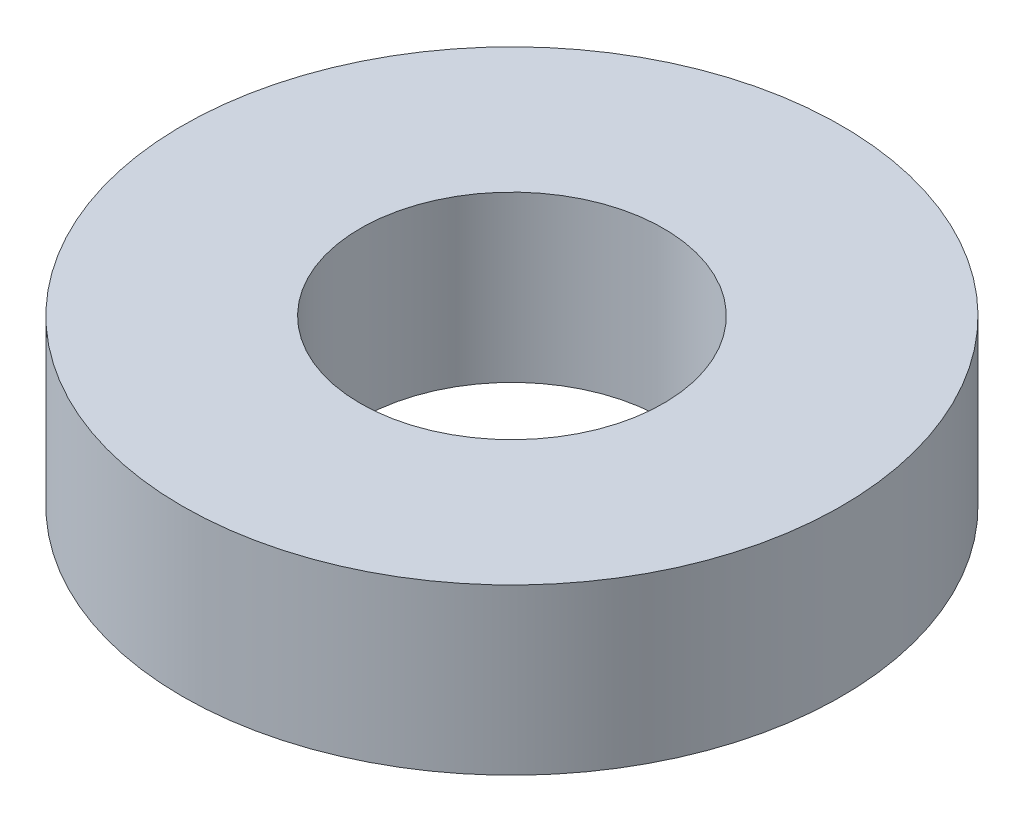
ISO-10303-21;
HEADER;
FILE_DESCRIPTION(('STEP AP214'),'2;1');
FILE_NAME('part.step','',(''),(''),'','','');
FILE_SCHEMA(('AUTOMOTIVE_DESIGN { 1 0 10303 214 1 1 1 1 }'));
ENDSEC;
DATA;
#1=APPLICATION_CONTEXT('core data for automotive mechanical design processes');
#2=APPLICATION_PROTOCOL_DEFINITION('international standard','automotive_design',2000,#1);
#3=PRODUCT_CONTEXT('',#1,'mechanical');
#4=PRODUCT('Part','Part','',(#3));
#5=PRODUCT_RELATED_PRODUCT_CATEGORY('part','',(#4));
#6=PRODUCT_DEFINITION_FORMATION('','',#4);
#7=PRODUCT_DEFINITION_CONTEXT('part definition',#1,'design');
#8=PRODUCT_DEFINITION('design','',#6,#7);
#9=PRODUCT_DEFINITION_SHAPE('','',#8);
#10=(LENGTH_UNIT() NAMED_UNIT(*) SI_UNIT(.MILLI.,.METRE.));
#11=(NAMED_UNIT(*) PLANE_ANGLE_UNIT() SI_UNIT($,.RADIAN.));
#12=(NAMED_UNIT(*) SI_UNIT($,.STERADIAN.) SOLID_ANGLE_UNIT());
#13=UNCERTAINTY_MEASURE_WITH_UNIT(LENGTH_MEASURE(1.E-05),#10,'distance_accuracy_value','');
#14=(GEOMETRIC_REPRESENTATION_CONTEXT(3) GLOBAL_UNCERTAINTY_ASSIGNED_CONTEXT((#13)) GLOBAL_UNIT_ASSIGNED_CONTEXT((#10,
#11,#12)) REPRESENTATION_CONTEXT('',''));
#15=CARTESIAN_POINT('',(0.,0.,0.));
#16=DIRECTION('',(0.,0.,1.));
#17=DIRECTION('',(1.,0.,0.));
#18=AXIS2_PLACEMENT_3D('',#15,#16,#17);
#19=CARTESIAN_POINT('',(0.,1.5875,0.));
#20=DIRECTION('',(0.,1.,0.));
#21=DIRECTION('',(0.,0.,1.));
#22=AXIS2_PLACEMENT_3D('',#19,#20,#21);
#23=PLANE('',#22);
#24=CARTESIAN_POINT('',(0.,1.5875,0.));
#25=DIRECTION('',(0.,1.,0.));
#26=DIRECTION('',(0.,0.,1.));
#27=AXIS2_PLACEMENT_3D('',#24,#25,#26);
#28=CIRCLE('',#27,3.175);
#29=CARTESIAN_POINT('',(0.,1.5875,3.175));
#30=VERTEX_POINT('',#29);
#31=EDGE_CURVE('E10',#30,#30,#28,.T.);
#32=ORIENTED_EDGE('',*,*,#31,.T.);
#33=EDGE_LOOP('',(#32));
#34=FACE_BOUND('',#33,.T.);
#35=CARTESIAN_POINT('',(0.,1.5875,0.));
#36=DIRECTION('',(0.,1.,0.));
#37=DIRECTION('',(0.,0.,1.));
#38=AXIS2_PLACEMENT_3D('',#35,#36,#37);
#39=CIRCLE('',#38,1.4605);
#40=CARTESIAN_POINT('',(0.,1.5875,1.4605));
#41=VERTEX_POINT('',#40);
#42=EDGE_CURVE('E42',#41,#41,#39,.T.);
#43=ORIENTED_EDGE('',*,*,#42,.F.);
#44=EDGE_LOOP('',(#43));
#45=FACE_BOUND('',#44,.T.);
#46=ADVANCED_FACE('F31',(#34,#45),#23,.T.);
#47=CARTESIAN_POINT('',(0.,0.,0.));
#48=DIRECTION('',(0.,1.,0.));
#49=DIRECTION('',(0.,0.,1.));
#50=AXIS2_PLACEMENT_3D('',#47,#48,#49);
#51=PLANE('',#50);
#52=CARTESIAN_POINT('',(0.,0.,0.));
#53=DIRECTION('',(0.,1.,0.));
#54=DIRECTION('',(0.,0.,1.));
#55=AXIS2_PLACEMENT_3D('',#52,#53,#54);
#56=CIRCLE('',#55,3.175);
#57=CARTESIAN_POINT('',(0.,0.,3.175));
#58=VERTEX_POINT('',#57);
#59=EDGE_CURVE('E35',#58,#58,#56,.T.);
#60=ORIENTED_EDGE('',*,*,#59,.F.);
#61=EDGE_LOOP('',(#60));
#62=FACE_BOUND('',#61,.T.);
#63=CARTESIAN_POINT('',(0.,0.,0.));
#64=DIRECTION('',(0.,1.,0.));
#65=DIRECTION('',(0.,0.,1.));
#66=AXIS2_PLACEMENT_3D('',#63,#64,#65);
#67=CIRCLE('',#66,1.4605);
#68=CARTESIAN_POINT('',(0.,0.,1.4605));
#69=VERTEX_POINT('',#68);
#70=EDGE_CURVE('E44',#69,#69,#67,.T.);
#71=ORIENTED_EDGE('',*,*,#70,.T.);
#72=EDGE_LOOP('',(#71));
#73=FACE_BOUND('',#72,.T.);
#74=ADVANCED_FACE('F54',(#62,#73),#51,.F.);
#75=CARTESIAN_POINT('',(0.,1.5875,0.));
#76=DIRECTION('',(0.,-1.,0.));
#77=DIRECTION('',(0.,0.,-1.));
#78=AXIS2_PLACEMENT_3D('',#75,#76,#77);
#79=CYLINDRICAL_SURFACE('',#78,3.175);
#80=ORIENTED_EDGE('',*,*,#31,.F.);
#81=EDGE_LOOP('',(#80));
#82=FACE_BOUND('',#81,.T.);
#83=ORIENTED_EDGE('',*,*,#59,.T.);
#84=EDGE_LOOP('',(#83));
#85=FACE_BOUND('',#84,.T.);
#86=ADVANCED_FACE('F33',(#82,#85),#79,.T.);
#87=CARTESIAN_POINT('',(0.,1.5875,0.));
#88=DIRECTION('',(0.,-1.,0.));
#89=DIRECTION('',(0.,0.,-1.));
#90=AXIS2_PLACEMENT_3D('',#87,#88,#89);
#91=CYLINDRICAL_SURFACE('',#90,1.4605);
#92=ORIENTED_EDGE('',*,*,#42,.T.);
#93=EDGE_LOOP('',(#92));
#94=FACE_BOUND('',#93,.T.);
#95=ORIENTED_EDGE('',*,*,#70,.F.);
#96=EDGE_LOOP('',(#95));
#97=FACE_BOUND('',#96,.T.);
#98=ADVANCED_FACE('F50',(#94,#97),#91,.F.);
#99=CLOSED_SHELL('',(#46,#74,#86,#98));
#100=MANIFOLD_SOLID_BREP('B2',#99);
#101=ADVANCED_BREP_SHAPE_REPRESENTATION('',(#18,#100),#14);
#102=SHAPE_DEFINITION_REPRESENTATION(#9,#101);
ENDSEC;
END-ISO-10303-21;
